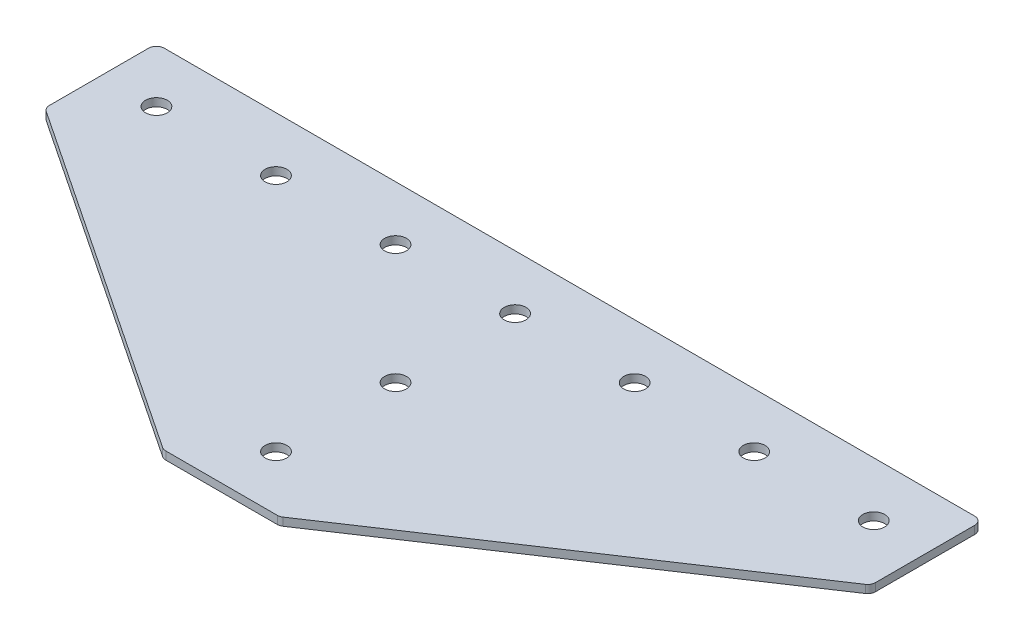
ISO-10303-21;
HEADER;
FILE_DESCRIPTION(('STEP AP214'),'2;1');
FILE_NAME('part.step','',(''),(''),'','','');
FILE_SCHEMA(('AUTOMOTIVE_DESIGN { 1 0 10303 214 1 1 1 1 }'));
ENDSEC;
DATA;
#1=APPLICATION_CONTEXT('core data for automotive mechanical design processes');
#2=APPLICATION_PROTOCOL_DEFINITION('international standard','automotive_design',2000,#1);
#3=PRODUCT_CONTEXT('',#1,'mechanical');
#4=PRODUCT('Part','Part','',(#3));
#5=PRODUCT_RELATED_PRODUCT_CATEGORY('part','',(#4));
#6=PRODUCT_DEFINITION_FORMATION('','',#4);
#7=PRODUCT_DEFINITION_CONTEXT('part definition',#1,'design');
#8=PRODUCT_DEFINITION('design','',#6,#7);
#9=PRODUCT_DEFINITION_SHAPE('','',#8);
#10=(LENGTH_UNIT() NAMED_UNIT(*) SI_UNIT(.MILLI.,.METRE.));
#11=(NAMED_UNIT(*) PLANE_ANGLE_UNIT() SI_UNIT($,.RADIAN.));
#12=(NAMED_UNIT(*) SI_UNIT($,.STERADIAN.) SOLID_ANGLE_UNIT());
#13=UNCERTAINTY_MEASURE_WITH_UNIT(LENGTH_MEASURE(1.E-05),#10,'distance_accuracy_value','');
#14=(GEOMETRIC_REPRESENTATION_CONTEXT(3) GLOBAL_UNCERTAINTY_ASSIGNED_CONTEXT((#13)) GLOBAL_UNIT_ASSIGNED_CONTEXT((#10,
#11,#12)) REPRESENTATION_CONTEXT('',''));
#15=CARTESIAN_POINT('',(0.,0.,0.));
#16=DIRECTION('',(0.,0.,1.));
#17=DIRECTION('',(1.,0.,0.));
#18=AXIS2_PLACEMENT_3D('',#15,#16,#17);
#19=CARTESIAN_POINT('',(-1.37420990733972,1.42462627720624,-46.5499410746997));
#20=DIRECTION('',(0.,-1.,0.));
#21=DIRECTION('',(0.,0.,-1.));
#22=AXIS2_PLACEMENT_3D('',#19,#20,#21);
#23=PLANE('',#22);
#24=CARTESIAN_POINT('',(-1.37420990733972,1.42462627720624,-46.5499410746997));
#25=DIRECTION('',(0.,1.,0.));
#26=DIRECTION('',(0.,0.,1.));
#27=AXIS2_PLACEMENT_3D('',#24,#25,#26);
#28=CIRCLE('',#27,4.1);
#29=CARTESIAN_POINT('',(-1.37420990733972,1.42462627720624,-42.4499410746997));
#30=VERTEX_POINT('',#29);
#31=EDGE_CURVE('E119',#30,#30,#28,.T.);
#32=ORIENTED_EDGE('',*,*,#31,.T.);
#33=EDGE_LOOP('',(#32));
#34=FACE_BOUND('',#33,.T.);
#35=DIRECTION('',(1.,0.,0.));
#36=VECTOR('',#35,1.);
#37=CARTESIAN_POINT('',(-21.8742099073397,1.42462627720624,63.9500589253003));
#38=LINE('',#37,#36);
#39=CARTESIAN_POINT('',(-22.3603317186797,1.42462627720624,63.9500589253003));
#40=VERTEX_POINT('',#39);
#41=CARTESIAN_POINT('',(19.6119119040003,1.42462627720624,63.9500589253003));
#42=VERTEX_POINT('',#41);
#43=EDGE_CURVE('E176',#40,#42,#38,.T.);
#44=ORIENTED_EDGE('',*,*,#43,.F.);
#45=CARTESIAN_POINT('',(-22.3603317186797,1.42462627720624,60.9500589253003));
#46=DIRECTION('',(0.,1.,0.));
#47=DIRECTION('',(0.,0.,-1.));
#48=AXIS2_PLACEMENT_3D('',#45,#46,#47);
#49=CIRCLE('',#48,3.);
#50=CARTESIAN_POINT('',(-24.0244323073554,1.42462627720624,63.4462098083138));
#51=VERTEX_POINT('',#50);
#52=EDGE_CURVE('E233',#51,#40,#49,.T.);
#53=ORIENTED_EDGE('',*,*,#52,.F.);
#54=DIRECTION('',(-0.832050294337844,0.,-0.554700196225229));
#55=VECTOR('',#54,1.);
#56=CARTESIAN_POINT('',(-23.2686586318757,1.42462627720624,63.9500589253003));
#57=LINE('',#56,#55);
#58=CARTESIAN_POINT('',(-155.538310496015,1.42462627720624,-24.2297089841261));
#59=VERTEX_POINT('',#58);
#60=EDGE_CURVE('E236',#51,#59,#57,.T.);
#61=ORIENTED_EDGE('',*,*,#60,.T.);
#62=CARTESIAN_POINT('',(-153.87420990734,1.42462627720624,-26.7258598671396));
#63=DIRECTION('',(0.,1.,0.));
#64=DIRECTION('',(0.,0.,-1.));
#65=AXIS2_PLACEMENT_3D('',#62,#63,#64);
#66=CIRCLE('',#65,3.);
#67=CARTESIAN_POINT('',(-156.87420990734,1.42462627720624,-26.7258598671396));
#68=VERTEX_POINT('',#67);
#69=EDGE_CURVE('E239',#68,#59,#66,.T.);
#70=ORIENTED_EDGE('',*,*,#69,.F.);
#71=DIRECTION('',(0.,0.,-1.));
#72=VECTOR('',#71,1.);
#73=CARTESIAN_POINT('',(-156.87420990734,1.42462627720624,-25.1203085916756));
#74=LINE('',#73,#72);
#75=CARTESIAN_POINT('',(-156.87420990734,1.42462627720624,-64.0499410746997));
#76=VERTEX_POINT('',#75);
#77=EDGE_CURVE('E130',#68,#76,#74,.T.);
#78=ORIENTED_EDGE('',*,*,#77,.T.);
#79=CARTESIAN_POINT('',(-153.87420990734,1.42462627720624,-64.0499410746997));
#80=DIRECTION('',(0.,1.,0.));
#81=DIRECTION('',(0.,0.,-1.));
#82=AXIS2_PLACEMENT_3D('',#79,#80,#81);
#83=CIRCLE('',#82,3.);
#84=CARTESIAN_POINT('',(-153.87420990734,1.42462627720624,-67.0499410746997));
#85=VERTEX_POINT('',#84);
#86=EDGE_CURVE('E245',#85,#76,#83,.T.);
#87=ORIENTED_EDGE('',*,*,#86,.F.);
#88=DIRECTION('',(-1.,0.,0.));
#89=VECTOR('',#88,1.);
#90=CARTESIAN_POINT('',(154.12579009266,1.42462627720624,-67.0499410746998));
#91=LINE('',#90,#89);
#92=CARTESIAN_POINT('',(151.12579009266,1.42462627720624,-67.0499410746998));
#93=VERTEX_POINT('',#92);
#94=EDGE_CURVE('E134',#93,#85,#91,.T.);
#95=ORIENTED_EDGE('',*,*,#94,.F.);
#96=CARTESIAN_POINT('',(151.12579009266,1.42462627720624,-64.0499410746998));
#97=DIRECTION('',(0.,-1.,0.));
#98=DIRECTION('',(0.,0.,-1.));
#99=AXIS2_PLACEMENT_3D('',#96,#97,#98);
#100=CIRCLE('',#99,3.);
#101=CARTESIAN_POINT('',(154.12579009266,1.42462627720624,-64.0499410746998));
#102=VERTEX_POINT('',#101);
#103=EDGE_CURVE('E197',#93,#102,#100,.T.);
#104=ORIENTED_EDGE('',*,*,#103,.T.);
#105=DIRECTION('',(0.,0.,-1.));
#106=VECTOR('',#105,1.);
#107=CARTESIAN_POINT('',(154.12579009266,1.42462627720624,-25.1203085916757));
#108=LINE('',#107,#106);
#109=CARTESIAN_POINT('',(154.12579009266,1.42462627720624,-26.7258598671397));
#110=VERTEX_POINT('',#109);
#111=EDGE_CURVE('E181',#110,#102,#108,.T.);
#112=ORIENTED_EDGE('',*,*,#111,.F.);
#113=CARTESIAN_POINT('',(151.12579009266,1.42462627720624,-26.7258598671397));
#114=DIRECTION('',(0.,-1.,0.));
#115=DIRECTION('',(0.,0.,-1.));
#116=AXIS2_PLACEMENT_3D('',#113,#114,#115);
#117=CIRCLE('',#116,3.);
#118=CARTESIAN_POINT('',(152.789890681336,1.42462627720624,-24.2297089841261));
#119=VERTEX_POINT('',#118);
#120=EDGE_CURVE('E31',#110,#119,#117,.T.);
#121=ORIENTED_EDGE('',*,*,#120,.T.);
#122=DIRECTION('',(0.832050294337844,0.,-0.554700196225229));
#123=VECTOR('',#122,1.);
#124=CARTESIAN_POINT('',(20.5202388171963,1.42462627720624,63.9500589253003));
#125=LINE('',#124,#123);
#126=CARTESIAN_POINT('',(21.276012492676,1.42462627720624,63.4462098083138));
#127=VERTEX_POINT('',#126);
#128=EDGE_CURVE('E179',#127,#119,#125,.T.);
#129=ORIENTED_EDGE('',*,*,#128,.F.);
#130=CARTESIAN_POINT('',(19.6119119040003,1.42462627720624,60.9500589253003));
#131=DIRECTION('',(0.,-1.,0.));
#132=DIRECTION('',(0.,0.,-1.));
#133=AXIS2_PLACEMENT_3D('',#130,#131,#132);
#134=CIRCLE('',#133,3.);
#135=EDGE_CURVE('E200',#127,#42,#134,.T.);
#136=ORIENTED_EDGE('',*,*,#135,.T.);
#137=EDGE_LOOP('',(#44,#53,#61,#70,#78,#87,#95,#104,#112,#121,#129,#136));
#138=FACE_BOUND('',#137,.T.);
#139=CARTESIAN_POINT('',(-1.37420990733973,1.42462627720624,43.4500589253003));
#140=DIRECTION('',(0.,1.,0.));
#141=DIRECTION('',(0.,0.,1.));
#142=AXIS2_PLACEMENT_3D('',#139,#140,#141);
#143=CIRCLE('',#142,4.1);
#144=CARTESIAN_POINT('',(-1.37420990733973,1.42462627720624,47.5500589253003));
#145=VERTEX_POINT('',#144);
#146=EDGE_CURVE('E153',#145,#145,#143,.T.);
#147=ORIENTED_EDGE('',*,*,#146,.T.);
#148=EDGE_LOOP('',(#147));
#149=FACE_BOUND('',#148,.T.);
#150=CARTESIAN_POINT('',(-1.37420990733973,1.42462627720624,-1.54994107469972));
#151=DIRECTION('',(0.,1.,0.));
#152=DIRECTION('',(0.,0.,1.));
#153=AXIS2_PLACEMENT_3D('',#150,#151,#152);
#154=CIRCLE('',#153,4.1);
#155=CARTESIAN_POINT('',(-1.37420990733973,1.42462627720624,2.55005892530028));
#156=VERTEX_POINT('',#155);
#157=EDGE_CURVE('E159',#156,#156,#154,.T.);
#158=ORIENTED_EDGE('',*,*,#157,.T.);
#159=EDGE_LOOP('',(#158));
#160=FACE_BOUND('',#159,.T.);
#161=CARTESIAN_POINT('',(133.62579009266,1.42462627720624,-46.5499410746997));
#162=DIRECTION('',(0.,1.,0.));
#163=DIRECTION('',(0.,0.,1.));
#164=AXIS2_PLACEMENT_3D('',#161,#162,#163);
#165=CIRCLE('',#164,4.09999999999999);
#166=CARTESIAN_POINT('',(133.62579009266,1.42462627720624,-42.4499410746997));
#167=VERTEX_POINT('',#166);
#168=EDGE_CURVE('E139',#167,#167,#165,.T.);
#169=ORIENTED_EDGE('',*,*,#168,.T.);
#170=EDGE_LOOP('',(#169));
#171=FACE_BOUND('',#170,.T.);
#172=CARTESIAN_POINT('',(88.6257900926603,1.42462627720624,-46.5499410746997));
#173=DIRECTION('',(0.,1.,0.));
#174=DIRECTION('',(0.,0.,1.));
#175=AXIS2_PLACEMENT_3D('',#172,#173,#174);
#176=CIRCLE('',#175,4.09999999999999);
#177=CARTESIAN_POINT('',(88.6257900926603,1.42462627720624,-42.4499410746997));
#178=VERTEX_POINT('',#177);
#179=EDGE_CURVE('E147',#178,#178,#176,.T.);
#180=ORIENTED_EDGE('',*,*,#179,.T.);
#181=EDGE_LOOP('',(#180));
#182=FACE_BOUND('',#181,.T.);
#183=CARTESIAN_POINT('',(43.6257900926603,1.42462627720624,-46.5499410746997));
#184=DIRECTION('',(0.,1.,0.));
#185=DIRECTION('',(0.,0.,1.));
#186=AXIS2_PLACEMENT_3D('',#183,#184,#185);
#187=CIRCLE('',#186,4.1);
#188=CARTESIAN_POINT('',(43.6257900926603,1.42462627720624,-42.4499410746997));
#189=VERTEX_POINT('',#188);
#190=EDGE_CURVE('E165',#189,#189,#187,.T.);
#191=ORIENTED_EDGE('',*,*,#190,.T.);
#192=EDGE_LOOP('',(#191));
#193=FACE_BOUND('',#192,.T.);
#194=CARTESIAN_POINT('',(-136.37420990734,1.42462627720624,-46.5499410746997));
#195=DIRECTION('',(0.,-1.,0.));
#196=DIRECTION('',(0.,0.,1.));
#197=AXIS2_PLACEMENT_3D('',#194,#195,#196);
#198=CIRCLE('',#197,4.09999999999999);
#199=CARTESIAN_POINT('',(-136.37420990734,1.42462627720624,-42.4499410746997));
#200=VERTEX_POINT('',#199);
#201=EDGE_CURVE('E465',#200,#200,#198,.T.);
#202=ORIENTED_EDGE('',*,*,#201,.F.);
#203=EDGE_LOOP('',(#202));
#204=FACE_BOUND('',#203,.T.);
#205=CARTESIAN_POINT('',(-91.3742099073397,1.42462627720624,-46.5499410746997));
#206=DIRECTION('',(0.,-1.,0.));
#207=DIRECTION('',(0.,0.,1.));
#208=AXIS2_PLACEMENT_3D('',#205,#206,#207);
#209=CIRCLE('',#208,4.09999999999999);
#210=CARTESIAN_POINT('',(-91.3742099073397,1.42462627720624,-42.4499410746997));
#211=VERTEX_POINT('',#210);
#212=EDGE_CURVE('E474',#211,#211,#209,.T.);
#213=ORIENTED_EDGE('',*,*,#212,.F.);
#214=EDGE_LOOP('',(#213));
#215=FACE_BOUND('',#214,.T.);
#216=CARTESIAN_POINT('',(-46.3742099073397,1.42462627720624,-46.5499410746997));
#217=DIRECTION('',(0.,-1.,0.));
#218=DIRECTION('',(0.,0.,1.));
#219=AXIS2_PLACEMENT_3D('',#216,#217,#218);
#220=CIRCLE('',#219,4.1);
#221=CARTESIAN_POINT('',(-46.3742099073397,1.42462627720624,-42.4499410746997));
#222=VERTEX_POINT('',#221);
#223=EDGE_CURVE('E266',#222,#222,#220,.T.);
#224=ORIENTED_EDGE('',*,*,#223,.F.);
#225=EDGE_LOOP('',(#224));
#226=FACE_BOUND('',#225,.T.);
#227=ADVANCED_FACE('F16',(#34,#138,#149,#160,#171,#182,#193,#204,#215,#226),#23,.T.);
#228=CARTESIAN_POINT('',(154.12579009266,1.42462627720624,-67.0499410746998));
#229=DIRECTION('',(0.,0.,-1.));
#230=DIRECTION('',(-1.,0.,0.));
#231=AXIS2_PLACEMENT_3D('',#228,#229,#230);
#232=PLANE('',#231);
#233=ORIENTED_EDGE('',*,*,#94,.T.);
#234=DIRECTION('',(0.,1.,0.));
#235=VECTOR('',#234,1.);
#236=CARTESIAN_POINT('',(-153.87420990734,1.42462627720624,-67.0499410746997));
#237=LINE('',#236,#235);
#238=CARTESIAN_POINT('',(-153.87420990734,4.42462627720624,-67.0499410746997));
#239=VERTEX_POINT('',#238);
#240=EDGE_CURVE('E125',#239,#85,#237,.F.);
#241=ORIENTED_EDGE('',*,*,#240,.F.);
#242=DIRECTION('',(-1.,0.,0.));
#243=VECTOR('',#242,1.);
#244=CARTESIAN_POINT('',(154.12579009266,4.42462627720624,-67.0499410746998));
#245=LINE('',#244,#243);
#246=CARTESIAN_POINT('',(151.12579009266,4.42462627720624,-67.0499410746998));
#247=VERTEX_POINT('',#246);
#248=EDGE_CURVE('E105',#247,#239,#245,.T.);
#249=ORIENTED_EDGE('',*,*,#248,.F.);
#250=DIRECTION('',(0.,1.,0.));
#251=VECTOR('',#250,1.);
#252=CARTESIAN_POINT('',(151.12579009266,1.42462627720624,-67.0499410746998));
#253=LINE('',#252,#251);
#254=EDGE_CURVE('E10',#247,#93,#253,.F.);
#255=ORIENTED_EDGE('',*,*,#254,.T.);
#256=EDGE_LOOP('',(#233,#241,#249,#255));
#257=FACE_BOUND('',#256,.T.);
#258=ADVANCED_FACE('F132',(#257),#232,.T.);
#259=CARTESIAN_POINT('',(154.12579009266,1.42462627720624,-25.1203085916757));
#260=DIRECTION('',(1.,0.,0.));
#261=DIRECTION('',(0.,0.,-1.));
#262=AXIS2_PLACEMENT_3D('',#259,#260,#261);
#263=PLANE('',#262);
#264=DIRECTION('',(0.,0.,-1.));
#265=VECTOR('',#264,1.);
#266=CARTESIAN_POINT('',(154.12579009266,4.42462627720624,-25.1203085916757));
#267=LINE('',#266,#265);
#268=CARTESIAN_POINT('',(154.12579009266,4.42462627720624,-26.7258598671397));
#269=VERTEX_POINT('',#268);
#270=CARTESIAN_POINT('',(154.12579009266,4.42462627720624,-64.0499410746998));
#271=VERTEX_POINT('',#270);
#272=EDGE_CURVE('E177',#269,#271,#267,.T.);
#273=ORIENTED_EDGE('',*,*,#272,.F.);
#274=DIRECTION('',(0.,1.,0.));
#275=VECTOR('',#274,1.);
#276=CARTESIAN_POINT('',(154.12579009266,1.42462627720624,-26.7258598671397));
#277=LINE('',#276,#275);
#278=EDGE_CURVE('E24',#269,#110,#277,.F.);
#279=ORIENTED_EDGE('',*,*,#278,.T.);
#280=ORIENTED_EDGE('',*,*,#111,.T.);
#281=DIRECTION('',(0.,1.,0.));
#282=VECTOR('',#281,1.);
#283=CARTESIAN_POINT('',(154.12579009266,1.42462627720624,-64.0499410746998));
#284=LINE('',#283,#282);
#285=EDGE_CURVE('E207',#102,#271,#284,.T.);
#286=ORIENTED_EDGE('',*,*,#285,.T.);
#287=EDGE_LOOP('',(#273,#279,#280,#286));
#288=FACE_BOUND('',#287,.T.);
#289=ADVANCED_FACE('F212',(#288),#263,.T.);
#290=CARTESIAN_POINT('',(20.5202388171963,1.42462627720624,63.9500589253003));
#291=DIRECTION('',(0.554700196225229,0.,0.832050294337844));
#292=DIRECTION('',(0.832050294337844,0.,-0.554700196225229));
#293=AXIS2_PLACEMENT_3D('',#290,#291,#292);
#294=PLANE('',#293);
#295=DIRECTION('',(0.832050294337844,0.,-0.554700196225229));
#296=VECTOR('',#295,1.);
#297=CARTESIAN_POINT('',(20.5202388171963,4.42462627720624,63.9500589253003));
#298=LINE('',#297,#296);
#299=CARTESIAN_POINT('',(21.276012492676,4.42462627720624,63.4462098083138));
#300=VERTEX_POINT('',#299);
#301=CARTESIAN_POINT('',(152.789890681336,4.42462627720624,-24.2297089841261));
#302=VERTEX_POINT('',#301);
#303=EDGE_CURVE('E185',#300,#302,#298,.T.);
#304=ORIENTED_EDGE('',*,*,#303,.F.);
#305=DIRECTION('',(0.,1.,0.));
#306=VECTOR('',#305,1.);
#307=CARTESIAN_POINT('',(21.276012492676,1.42462627720624,63.4462098083138));
#308=LINE('',#307,#306);
#309=EDGE_CURVE('E38',#300,#127,#308,.F.);
#310=ORIENTED_EDGE('',*,*,#309,.T.);
#311=ORIENTED_EDGE('',*,*,#128,.T.);
#312=DIRECTION('',(0.,1.,0.));
#313=VECTOR('',#312,1.);
#314=CARTESIAN_POINT('',(152.789890681336,1.42462627720624,-24.2297089841261));
#315=LINE('',#314,#313);
#316=EDGE_CURVE('E203',#119,#302,#315,.T.);
#317=ORIENTED_EDGE('',*,*,#316,.T.);
#318=EDGE_LOOP('',(#304,#310,#311,#317));
#319=FACE_BOUND('',#318,.T.);
#320=ADVANCED_FACE('F219',(#319),#294,.T.);
#321=CARTESIAN_POINT('',(-21.8742099073397,1.42462627720624,63.9500589253003));
#322=DIRECTION('',(0.,0.,1.));
#323=DIRECTION('',(1.,0.,0.));
#324=AXIS2_PLACEMENT_3D('',#321,#322,#323);
#325=PLANE('',#324);
#326=DIRECTION('',(1.,0.,0.));
#327=VECTOR('',#326,1.);
#328=CARTESIAN_POINT('',(-21.8742099073397,4.42462627720624,63.9500589253003));
#329=LINE('',#328,#327);
#330=CARTESIAN_POINT('',(-22.3603317186797,4.42462627720624,63.9500589253003));
#331=VERTEX_POINT('',#330);
#332=CARTESIAN_POINT('',(19.6119119040003,4.42462627720624,63.9500589253003));
#333=VERTEX_POINT('',#332);
#334=EDGE_CURVE('E118',#331,#333,#329,.T.);
#335=ORIENTED_EDGE('',*,*,#334,.F.);
#336=DIRECTION('',(0.,1.,0.));
#337=VECTOR('',#336,1.);
#338=CARTESIAN_POINT('',(-22.3603317186797,1.42462627720624,63.9500589253003));
#339=LINE('',#338,#337);
#340=EDGE_CURVE('E229',#40,#331,#339,.T.);
#341=ORIENTED_EDGE('',*,*,#340,.F.);
#342=ORIENTED_EDGE('',*,*,#43,.T.);
#343=DIRECTION('',(0.,1.,0.));
#344=VECTOR('',#343,1.);
#345=CARTESIAN_POINT('',(19.6119119040003,1.42462627720624,63.9500589253003));
#346=LINE('',#345,#344);
#347=EDGE_CURVE('E194',#42,#333,#346,.T.);
#348=ORIENTED_EDGE('',*,*,#347,.T.);
#349=EDGE_LOOP('',(#335,#341,#342,#348));
#350=FACE_BOUND('',#349,.T.);
#351=ADVANCED_FACE('F226',(#350),#325,.T.);
#352=CARTESIAN_POINT('',(-1.37420990733972,4.42462627720624,-46.5499410746997));
#353=DIRECTION('',(0.,-1.,0.));
#354=DIRECTION('',(0.,0.,-1.));
#355=AXIS2_PLACEMENT_3D('',#352,#353,#354);
#356=PLANE('',#355);
#357=CARTESIAN_POINT('',(-1.37420990733972,4.42462627720624,-46.5499410746997));
#358=DIRECTION('',(0.,1.,0.));
#359=DIRECTION('',(0.,0.,1.));
#360=AXIS2_PLACEMENT_3D('',#357,#358,#359);
#361=CIRCLE('',#360,4.1);
#362=CARTESIAN_POINT('',(-1.37420990733972,4.42462627720624,-42.4499410746997));
#363=VERTEX_POINT('',#362);
#364=EDGE_CURVE('E168',#363,#363,#361,.T.);
#365=ORIENTED_EDGE('',*,*,#364,.F.);
#366=EDGE_LOOP('',(#365));
#367=FACE_BOUND('',#366,.T.);
#368=CARTESIAN_POINT('',(-22.3603317186797,4.42462627720624,60.9500589253003));
#369=DIRECTION('',(0.,1.,0.));
#370=DIRECTION('',(0.,0.,-1.));
#371=AXIS2_PLACEMENT_3D('',#368,#369,#370);
#372=CIRCLE('',#371,3.);
#373=CARTESIAN_POINT('',(-24.0244323073554,4.42462627720624,63.4462098083138));
#374=VERTEX_POINT('',#373);
#375=EDGE_CURVE('E251',#331,#374,#372,.F.);
#376=ORIENTED_EDGE('',*,*,#375,.F.);
#377=ORIENTED_EDGE('',*,*,#334,.T.);
#378=CARTESIAN_POINT('',(19.6119119040003,4.42462627720624,60.9500589253003));
#379=DIRECTION('',(0.,-1.,0.));
#380=DIRECTION('',(0.,0.,-1.));
#381=AXIS2_PLACEMENT_3D('',#378,#379,#380);
#382=CIRCLE('',#381,3.);
#383=EDGE_CURVE('E192',#333,#300,#382,.F.);
#384=ORIENTED_EDGE('',*,*,#383,.T.);
#385=ORIENTED_EDGE('',*,*,#303,.T.);
#386=CARTESIAN_POINT('',(151.12579009266,4.42462627720624,-26.7258598671397));
#387=DIRECTION('',(0.,-1.,0.));
#388=DIRECTION('',(0.,0.,-1.));
#389=AXIS2_PLACEMENT_3D('',#386,#387,#388);
#390=CIRCLE('',#389,3.);
#391=EDGE_CURVE('E190',#302,#269,#390,.F.);
#392=ORIENTED_EDGE('',*,*,#391,.T.);
#393=ORIENTED_EDGE('',*,*,#272,.T.);
#394=CARTESIAN_POINT('',(151.12579009266,4.42462627720624,-64.0499410746998));
#395=DIRECTION('',(0.,-1.,0.));
#396=DIRECTION('',(0.,0.,-1.));
#397=AXIS2_PLACEMENT_3D('',#394,#395,#396);
#398=CIRCLE('',#397,3.);
#399=EDGE_CURVE('E114',#271,#247,#398,.F.);
#400=ORIENTED_EDGE('',*,*,#399,.T.);
#401=ORIENTED_EDGE('',*,*,#248,.T.);
#402=CARTESIAN_POINT('',(-153.87420990734,4.42462627720624,-64.0499410746997));
#403=DIRECTION('',(0.,1.,0.));
#404=DIRECTION('',(0.,0.,-1.));
#405=AXIS2_PLACEMENT_3D('',#402,#403,#404);
#406=CIRCLE('',#405,3.);
#407=CARTESIAN_POINT('',(-156.87420990734,4.42462627720624,-64.0499410746997));
#408=VERTEX_POINT('',#407);
#409=EDGE_CURVE('E111',#408,#239,#406,.F.);
#410=ORIENTED_EDGE('',*,*,#409,.F.);
#411=DIRECTION('',(0.,0.,-1.));
#412=VECTOR('',#411,1.);
#413=CARTESIAN_POINT('',(-156.87420990734,4.42462627720624,-25.1203085916756));
#414=LINE('',#413,#412);
#415=CARTESIAN_POINT('',(-156.87420990734,4.42462627720624,-26.7258598671396));
#416=VERTEX_POINT('',#415);
#417=EDGE_CURVE('E256',#416,#408,#414,.T.);
#418=ORIENTED_EDGE('',*,*,#417,.F.);
#419=CARTESIAN_POINT('',(-153.87420990734,4.42462627720624,-26.7258598671396));
#420=DIRECTION('',(0.,1.,0.));
#421=DIRECTION('',(0.,0.,-1.));
#422=AXIS2_PLACEMENT_3D('',#419,#420,#421);
#423=CIRCLE('',#422,3.);
#424=CARTESIAN_POINT('',(-155.538310496015,4.42462627720624,-24.2297089841261));
#425=VERTEX_POINT('',#424);
#426=EDGE_CURVE('E129',#425,#416,#423,.F.);
#427=ORIENTED_EDGE('',*,*,#426,.F.);
#428=DIRECTION('',(-0.832050294337844,0.,-0.554700196225229));
#429=VECTOR('',#428,1.);
#430=CARTESIAN_POINT('',(-23.2686586318757,4.42462627720624,63.9500589253003));
#431=LINE('',#430,#429);
#432=EDGE_CURVE('E260',#374,#425,#431,.T.);
#433=ORIENTED_EDGE('',*,*,#432,.F.);
#434=EDGE_LOOP('',(#376,#377,#384,#385,#392,#393,#400,#401,#410,#418,#427,#433));
#435=FACE_BOUND('',#434,.T.);
#436=CARTESIAN_POINT('',(-1.37420990733973,4.42462627720624,43.4500589253003));
#437=DIRECTION('',(0.,1.,0.));
#438=DIRECTION('',(0.,0.,1.));
#439=AXIS2_PLACEMENT_3D('',#436,#437,#438);
#440=CIRCLE('',#439,4.1);
#441=CARTESIAN_POINT('',(-1.37420990733973,4.42462627720624,47.5500589253003));
#442=VERTEX_POINT('',#441);
#443=EDGE_CURVE('E150',#442,#442,#440,.T.);
#444=ORIENTED_EDGE('',*,*,#443,.F.);
#445=EDGE_LOOP('',(#444));
#446=FACE_BOUND('',#445,.T.);
#447=CARTESIAN_POINT('',(133.62579009266,4.42462627720624,-46.5499410746997));
#448=DIRECTION('',(0.,1.,0.));
#449=DIRECTION('',(0.,0.,1.));
#450=AXIS2_PLACEMENT_3D('',#447,#448,#449);
#451=CIRCLE('',#450,4.09999999999999);
#452=CARTESIAN_POINT('',(133.62579009266,4.42462627720624,-42.4499410746997));
#453=VERTEX_POINT('',#452);
#454=EDGE_CURVE('E135',#453,#453,#451,.T.);
#455=ORIENTED_EDGE('',*,*,#454,.F.);
#456=EDGE_LOOP('',(#455));
#457=FACE_BOUND('',#456,.T.);
#458=CARTESIAN_POINT('',(88.6257900926603,4.42462627720624,-46.5499410746997));
#459=DIRECTION('',(0.,1.,0.));
#460=DIRECTION('',(0.,0.,1.));
#461=AXIS2_PLACEMENT_3D('',#458,#459,#460);
#462=CIRCLE('',#461,4.09999999999999);
#463=CARTESIAN_POINT('',(88.6257900926603,4.42462627720624,-42.4499410746997));
#464=VERTEX_POINT('',#463);
#465=EDGE_CURVE('E145',#464,#464,#462,.T.);
#466=ORIENTED_EDGE('',*,*,#465,.F.);
#467=EDGE_LOOP('',(#466));
#468=FACE_BOUND('',#467,.T.);
#469=CARTESIAN_POINT('',(43.6257900926603,4.42462627720624,-46.5499410746997));
#470=DIRECTION('',(0.,1.,0.));
#471=DIRECTION('',(0.,0.,1.));
#472=AXIS2_PLACEMENT_3D('',#469,#470,#471);
#473=CIRCLE('',#472,4.1);
#474=CARTESIAN_POINT('',(43.6257900926603,4.42462627720624,-42.4499410746997));
#475=VERTEX_POINT('',#474);
#476=EDGE_CURVE('E162',#475,#475,#473,.T.);
#477=ORIENTED_EDGE('',*,*,#476,.F.);
#478=EDGE_LOOP('',(#477));
#479=FACE_BOUND('',#478,.T.);
#480=CARTESIAN_POINT('',(-1.37420990733973,4.42462627720624,-1.54994107469972));
#481=DIRECTION('',(0.,1.,0.));
#482=DIRECTION('',(0.,0.,1.));
#483=AXIS2_PLACEMENT_3D('',#480,#481,#482);
#484=CIRCLE('',#483,4.1);
#485=CARTESIAN_POINT('',(-1.37420990733973,4.42462627720624,2.55005892530028));
#486=VERTEX_POINT('',#485);
#487=EDGE_CURVE('E156',#486,#486,#484,.T.);
#488=ORIENTED_EDGE('',*,*,#487,.F.);
#489=EDGE_LOOP('',(#488));
#490=FACE_BOUND('',#489,.T.);
#491=CARTESIAN_POINT('',(-136.37420990734,4.42462627720624,-46.5499410746997));
#492=DIRECTION('',(0.,-1.,0.));
#493=DIRECTION('',(0.,0.,1.));
#494=AXIS2_PLACEMENT_3D('',#491,#492,#493);
#495=CIRCLE('',#494,4.09999999999999);
#496=CARTESIAN_POINT('',(-136.37420990734,4.42462627720624,-42.4499410746997));
#497=VERTEX_POINT('',#496);
#498=EDGE_CURVE('E468',#497,#497,#495,.T.);
#499=ORIENTED_EDGE('',*,*,#498,.T.);
#500=EDGE_LOOP('',(#499));
#501=FACE_BOUND('',#500,.T.);
#502=CARTESIAN_POINT('',(-91.3742099073397,4.42462627720624,-46.5499410746997));
#503=DIRECTION('',(0.,-1.,0.));
#504=DIRECTION('',(0.,0.,1.));
#505=AXIS2_PLACEMENT_3D('',#502,#503,#504);
#506=CIRCLE('',#505,4.09999999999999);
#507=CARTESIAN_POINT('',(-91.3742099073397,4.42462627720624,-42.4499410746997));
#508=VERTEX_POINT('',#507);
#509=EDGE_CURVE('E471',#508,#508,#506,.T.);
#510=ORIENTED_EDGE('',*,*,#509,.T.);
#511=EDGE_LOOP('',(#510));
#512=FACE_BOUND('',#511,.T.);
#513=CARTESIAN_POINT('',(-46.3742099073397,4.42462627720624,-46.5499410746997));
#514=DIRECTION('',(0.,-1.,0.));
#515=DIRECTION('',(0.,0.,1.));
#516=AXIS2_PLACEMENT_3D('',#513,#514,#515);
#517=CIRCLE('',#516,4.1);
#518=CARTESIAN_POINT('',(-46.3742099073397,4.42462627720624,-42.4499410746997));
#519=VERTEX_POINT('',#518);
#520=EDGE_CURVE('E263',#519,#519,#517,.T.);
#521=ORIENTED_EDGE('',*,*,#520,.T.);
#522=EDGE_LOOP('',(#521));
#523=FACE_BOUND('',#522,.T.);
#524=ADVANCED_FACE('F108',(#367,#435,#446,#457,#468,#479,#490,#501,#512,#523),#356,.F.);
#525=CARTESIAN_POINT('',(19.6119119040003,1.42462627720624,60.9500589253003));
#526=DIRECTION('',(0.,1.,0.));
#527=DIRECTION('',(0.,0.,1.));
#528=AXIS2_PLACEMENT_3D('',#525,#526,#527);
#529=CYLINDRICAL_SURFACE('',#528,3.);
#530=ORIENTED_EDGE('',*,*,#135,.F.);
#531=ORIENTED_EDGE('',*,*,#309,.F.);
#532=ORIENTED_EDGE('',*,*,#383,.F.);
#533=ORIENTED_EDGE('',*,*,#347,.F.);
#534=EDGE_LOOP('',(#530,#531,#532,#533));
#535=FACE_BOUND('',#534,.T.);
#536=ADVANCED_FACE('F224',(#535),#529,.T.);
#537=CARTESIAN_POINT('',(151.12579009266,1.42462627720624,-26.7258598671397));
#538=DIRECTION('',(0.,1.,0.));
#539=DIRECTION('',(0.,0.,1.));
#540=AXIS2_PLACEMENT_3D('',#537,#538,#539);
#541=CYLINDRICAL_SURFACE('',#540,3.);
#542=ORIENTED_EDGE('',*,*,#120,.F.);
#543=ORIENTED_EDGE('',*,*,#278,.F.);
#544=ORIENTED_EDGE('',*,*,#391,.F.);
#545=ORIENTED_EDGE('',*,*,#316,.F.);
#546=EDGE_LOOP('',(#542,#543,#544,#545));
#547=FACE_BOUND('',#546,.T.);
#548=ADVANCED_FACE('F218',(#547),#541,.T.);
#549=CARTESIAN_POINT('',(151.12579009266,1.42462627720624,-64.0499410746998));
#550=DIRECTION('',(0.,1.,0.));
#551=DIRECTION('',(0.,0.,1.));
#552=AXIS2_PLACEMENT_3D('',#549,#550,#551);
#553=CYLINDRICAL_SURFACE('',#552,3.);
#554=ORIENTED_EDGE('',*,*,#103,.F.);
#555=ORIENTED_EDGE('',*,*,#254,.F.);
#556=ORIENTED_EDGE('',*,*,#399,.F.);
#557=ORIENTED_EDGE('',*,*,#285,.F.);
#558=EDGE_LOOP('',(#554,#555,#556,#557));
#559=FACE_BOUND('',#558,.T.);
#560=ADVANCED_FACE('F18',(#559),#553,.T.);
#561=CARTESIAN_POINT('',(-1.37420990733972,1.42462627720624,-46.5499410746997));
#562=DIRECTION('',(0.,1.,0.));
#563=DIRECTION('',(0.,0.,1.));
#564=AXIS2_PLACEMENT_3D('',#561,#562,#563);
#565=CYLINDRICAL_SURFACE('',#564,4.1);
#566=ORIENTED_EDGE('',*,*,#31,.F.);
#567=EDGE_LOOP('',(#566));
#568=FACE_BOUND('',#567,.T.);
#569=ORIENTED_EDGE('',*,*,#364,.T.);
#570=EDGE_LOOP('',(#569));
#571=FACE_BOUND('',#570,.T.);
#572=ADVANCED_FACE('F300',(#568,#571),#565,.F.);
#573=CARTESIAN_POINT('',(43.6257900926603,1.42462627720624,-46.5499410746997));
#574=DIRECTION('',(0.,1.,0.));
#575=DIRECTION('',(0.,0.,1.));
#576=AXIS2_PLACEMENT_3D('',#573,#574,#575);
#577=CYLINDRICAL_SURFACE('',#576,4.1);
#578=ORIENTED_EDGE('',*,*,#190,.F.);
#579=EDGE_LOOP('',(#578));
#580=FACE_BOUND('',#579,.T.);
#581=ORIENTED_EDGE('',*,*,#476,.T.);
#582=EDGE_LOOP('',(#581));
#583=FACE_BOUND('',#582,.T.);
#584=ADVANCED_FACE('F305',(#580,#583),#577,.F.);
#585=CARTESIAN_POINT('',(-1.37420990733973,1.42462627720624,-1.54994107469972));
#586=DIRECTION('',(0.,1.,0.));
#587=DIRECTION('',(0.,0.,1.));
#588=AXIS2_PLACEMENT_3D('',#585,#586,#587);
#589=CYLINDRICAL_SURFACE('',#588,4.1);
#590=ORIENTED_EDGE('',*,*,#487,.T.);
#591=EDGE_LOOP('',(#590));
#592=FACE_BOUND('',#591,.T.);
#593=ORIENTED_EDGE('',*,*,#157,.F.);
#594=EDGE_LOOP('',(#593));
#595=FACE_BOUND('',#594,.T.);
#596=ADVANCED_FACE('F311',(#592,#595),#589,.F.);
#597=CARTESIAN_POINT('',(-1.37420990733973,1.42462627720624,43.4500589253003));
#598=DIRECTION('',(0.,1.,0.));
#599=DIRECTION('',(0.,0.,1.));
#600=AXIS2_PLACEMENT_3D('',#597,#598,#599);
#601=CYLINDRICAL_SURFACE('',#600,4.1);
#602=ORIENTED_EDGE('',*,*,#443,.T.);
#603=EDGE_LOOP('',(#602));
#604=FACE_BOUND('',#603,.T.);
#605=ORIENTED_EDGE('',*,*,#146,.F.);
#606=EDGE_LOOP('',(#605));
#607=FACE_BOUND('',#606,.T.);
#608=ADVANCED_FACE('F366',(#604,#607),#601,.F.);
#609=CARTESIAN_POINT('',(88.6257900926603,1.42462627720624,-46.5499410746997));
#610=DIRECTION('',(0.,1.,0.));
#611=DIRECTION('',(0.,0.,1.));
#612=AXIS2_PLACEMENT_3D('',#609,#610,#611);
#613=CYLINDRICAL_SURFACE('',#612,4.09999999999999);
#614=ORIENTED_EDGE('',*,*,#179,.F.);
#615=EDGE_LOOP('',(#614));
#616=FACE_BOUND('',#615,.T.);
#617=ORIENTED_EDGE('',*,*,#465,.T.);
#618=EDGE_LOOP('',(#617));
#619=FACE_BOUND('',#618,.T.);
#620=ADVANCED_FACE('F375',(#616,#619),#613,.F.);
#621=CARTESIAN_POINT('',(133.62579009266,1.42462627720624,-46.5499410746997));
#622=DIRECTION('',(0.,1.,0.));
#623=DIRECTION('',(0.,0.,1.));
#624=AXIS2_PLACEMENT_3D('',#621,#622,#623);
#625=CYLINDRICAL_SURFACE('',#624,4.09999999999999);
#626=ORIENTED_EDGE('',*,*,#168,.F.);
#627=EDGE_LOOP('',(#626));
#628=FACE_BOUND('',#627,.T.);
#629=ORIENTED_EDGE('',*,*,#454,.T.);
#630=EDGE_LOOP('',(#629));
#631=FACE_BOUND('',#630,.T.);
#632=ADVANCED_FACE('F385',(#628,#631),#625,.F.);
#633=CARTESIAN_POINT('',(-156.87420990734,1.42462627720624,-25.1203085916756));
#634=DIRECTION('',(-1.,0.,0.));
#635=DIRECTION('',(0.,0.,-1.));
#636=AXIS2_PLACEMENT_3D('',#633,#634,#635);
#637=PLANE('',#636);
#638=ORIENTED_EDGE('',*,*,#417,.T.);
#639=DIRECTION('',(0.,1.,0.));
#640=VECTOR('',#639,1.);
#641=CARTESIAN_POINT('',(-156.87420990734,1.42462627720624,-64.0499410746997));
#642=LINE('',#641,#640);
#643=EDGE_CURVE('E127',#76,#408,#642,.T.);
#644=ORIENTED_EDGE('',*,*,#643,.F.);
#645=ORIENTED_EDGE('',*,*,#77,.F.);
#646=DIRECTION('',(0.,1.,0.));
#647=VECTOR('',#646,1.);
#648=CARTESIAN_POINT('',(-156.87420990734,1.42462627720624,-26.7258598671396));
#649=LINE('',#648,#647);
#650=EDGE_CURVE('E136',#416,#68,#649,.F.);
#651=ORIENTED_EDGE('',*,*,#650,.F.);
#652=EDGE_LOOP('',(#638,#644,#645,#651));
#653=FACE_BOUND('',#652,.T.);
#654=ADVANCED_FACE('F273',(#653),#637,.T.);
#655=CARTESIAN_POINT('',(-23.2686586318757,1.42462627720624,63.9500589253003));
#656=DIRECTION('',(-0.554700196225229,0.,0.832050294337844));
#657=DIRECTION('',(-0.832050294337844,0.,-0.554700196225229));
#658=AXIS2_PLACEMENT_3D('',#655,#656,#657);
#659=PLANE('',#658);
#660=ORIENTED_EDGE('',*,*,#432,.T.);
#661=DIRECTION('',(0.,1.,0.));
#662=VECTOR('',#661,1.);
#663=CARTESIAN_POINT('',(-155.538310496015,1.42462627720624,-24.2297089841261));
#664=LINE('',#663,#662);
#665=EDGE_CURVE('E238',#59,#425,#664,.T.);
#666=ORIENTED_EDGE('',*,*,#665,.F.);
#667=ORIENTED_EDGE('',*,*,#60,.F.);
#668=DIRECTION('',(0.,1.,0.));
#669=VECTOR('',#668,1.);
#670=CARTESIAN_POINT('',(-24.0244323073554,1.42462627720624,63.4462098083138));
#671=LINE('',#670,#669);
#672=EDGE_CURVE('E242',#374,#51,#671,.F.);
#673=ORIENTED_EDGE('',*,*,#672,.F.);
#674=EDGE_LOOP('',(#660,#666,#667,#673));
#675=FACE_BOUND('',#674,.T.);
#676=ADVANCED_FACE('F255',(#675),#659,.T.);
#677=CARTESIAN_POINT('',(-22.3603317186797,1.42462627720624,60.9500589253003));
#678=DIRECTION('',(0.,1.,0.));
#679=DIRECTION('',(0.,0.,1.));
#680=AXIS2_PLACEMENT_3D('',#677,#678,#679);
#681=CYLINDRICAL_SURFACE('',#680,3.);
#682=ORIENTED_EDGE('',*,*,#52,.T.);
#683=ORIENTED_EDGE('',*,*,#340,.T.);
#684=ORIENTED_EDGE('',*,*,#375,.T.);
#685=ORIENTED_EDGE('',*,*,#672,.T.);
#686=EDGE_LOOP('',(#682,#683,#684,#685));
#687=FACE_BOUND('',#686,.T.);
#688=ADVANCED_FACE('F250',(#687),#681,.T.);
#689=CARTESIAN_POINT('',(-153.87420990734,1.42462627720624,-26.7258598671396));
#690=DIRECTION('',(0.,1.,0.));
#691=DIRECTION('',(0.,0.,1.));
#692=AXIS2_PLACEMENT_3D('',#689,#690,#691);
#693=CYLINDRICAL_SURFACE('',#692,3.);
#694=ORIENTED_EDGE('',*,*,#69,.T.);
#695=ORIENTED_EDGE('',*,*,#665,.T.);
#696=ORIENTED_EDGE('',*,*,#426,.T.);
#697=ORIENTED_EDGE('',*,*,#650,.T.);
#698=EDGE_LOOP('',(#694,#695,#696,#697));
#699=FACE_BOUND('',#698,.T.);
#700=ADVANCED_FACE('F275',(#699),#693,.T.);
#701=CARTESIAN_POINT('',(-153.87420990734,1.42462627720624,-64.0499410746997));
#702=DIRECTION('',(0.,1.,0.));
#703=DIRECTION('',(0.,0.,1.));
#704=AXIS2_PLACEMENT_3D('',#701,#702,#703);
#705=CYLINDRICAL_SURFACE('',#704,3.);
#706=ORIENTED_EDGE('',*,*,#86,.T.);
#707=ORIENTED_EDGE('',*,*,#643,.T.);
#708=ORIENTED_EDGE('',*,*,#409,.T.);
#709=ORIENTED_EDGE('',*,*,#240,.T.);
#710=EDGE_LOOP('',(#706,#707,#708,#709));
#711=FACE_BOUND('',#710,.T.);
#712=ADVANCED_FACE('F124',(#711),#705,.T.);
#713=CARTESIAN_POINT('',(-46.3742099073397,1.42462627720624,-46.5499410746997));
#714=DIRECTION('',(0.,1.,0.));
#715=DIRECTION('',(0.,0.,1.));
#716=AXIS2_PLACEMENT_3D('',#713,#714,#715);
#717=CYLINDRICAL_SURFACE('',#716,4.1);
#718=ORIENTED_EDGE('',*,*,#223,.T.);
#719=EDGE_LOOP('',(#718));
#720=FACE_BOUND('',#719,.T.);
#721=ORIENTED_EDGE('',*,*,#520,.F.);
#722=EDGE_LOOP('',(#721));
#723=FACE_BOUND('',#722,.T.);
#724=ADVANCED_FACE('F283',(#720,#723),#717,.F.);
#725=CARTESIAN_POINT('',(-91.3742099073397,1.42462627720624,-46.5499410746997));
#726=DIRECTION('',(0.,1.,0.));
#727=DIRECTION('',(0.,0.,1.));
#728=AXIS2_PLACEMENT_3D('',#725,#726,#727);
#729=CYLINDRICAL_SURFACE('',#728,4.09999999999999);
#730=ORIENTED_EDGE('',*,*,#212,.T.);
#731=EDGE_LOOP('',(#730));
#732=FACE_BOUND('',#731,.T.);
#733=ORIENTED_EDGE('',*,*,#509,.F.);
#734=EDGE_LOOP('',(#733));
#735=FACE_BOUND('',#734,.T.);
#736=ADVANCED_FACE('F436',(#732,#735),#729,.F.);
#737=CARTESIAN_POINT('',(-136.37420990734,1.42462627720624,-46.5499410746997));
#738=DIRECTION('',(0.,1.,0.));
#739=DIRECTION('',(0.,0.,1.));
#740=AXIS2_PLACEMENT_3D('',#737,#738,#739);
#741=CYLINDRICAL_SURFACE('',#740,4.09999999999999);
#742=ORIENTED_EDGE('',*,*,#201,.T.);
#743=EDGE_LOOP('',(#742));
#744=FACE_BOUND('',#743,.T.);
#745=ORIENTED_EDGE('',*,*,#498,.F.);
#746=EDGE_LOOP('',(#745));
#747=FACE_BOUND('',#746,.T.);
#748=ADVANCED_FACE('F446',(#744,#747),#741,.F.);
#749=CLOSED_SHELL('',(#227,#258,#289,#320,#351,#524,#536,#548,#560,#572,#584,#596,#608,#620,
#632,#654,#676,#688,#700,#712,#724,#736,#748));
#750=MANIFOLD_SOLID_BREP('B1',#749);
#751=ADVANCED_BREP_SHAPE_REPRESENTATION('',(#18,#750),#14);
#752=SHAPE_DEFINITION_REPRESENTATION(#9,#751);
ENDSEC;
END-ISO-10303-21;
